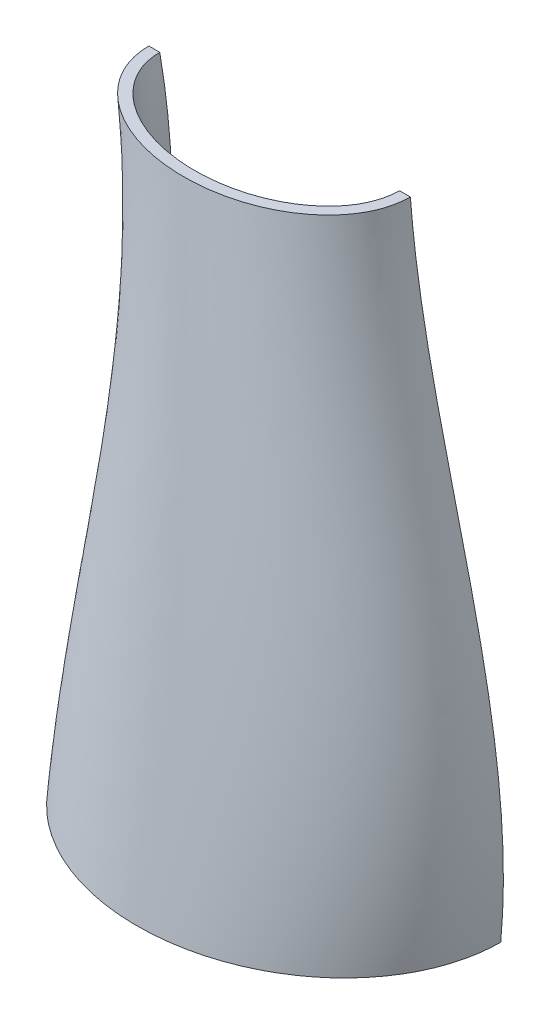
ISO-10303-21;
HEADER;
FILE_DESCRIPTION(('STEP AP214'),'2;1');
FILE_NAME('part.step','',(''),(''),'','','');
FILE_SCHEMA(('AUTOMOTIVE_DESIGN { 1 0 10303 214 1 1 1 1 }'));
ENDSEC;
DATA;
#1=APPLICATION_CONTEXT('core data for automotive mechanical design processes');
#2=APPLICATION_PROTOCOL_DEFINITION('international standard','automotive_design',2000,#1);
#3=PRODUCT_CONTEXT('',#1,'mechanical');
#4=PRODUCT('Part','Part','',(#3));
#5=PRODUCT_RELATED_PRODUCT_CATEGORY('part','',(#4));
#6=PRODUCT_DEFINITION_FORMATION('','',#4);
#7=PRODUCT_DEFINITION_CONTEXT('part definition',#1,'design');
#8=PRODUCT_DEFINITION('design','',#6,#7);
#9=PRODUCT_DEFINITION_SHAPE('','',#8);
#10=(LENGTH_UNIT() NAMED_UNIT(*) SI_UNIT(.MILLI.,.METRE.));
#11=(NAMED_UNIT(*) PLANE_ANGLE_UNIT() SI_UNIT($,.RADIAN.));
#12=(NAMED_UNIT(*) SI_UNIT($,.STERADIAN.) SOLID_ANGLE_UNIT());
#13=UNCERTAINTY_MEASURE_WITH_UNIT(LENGTH_MEASURE(1.E-05),#10,'distance_accuracy_value','');
#14=(GEOMETRIC_REPRESENTATION_CONTEXT(3) GLOBAL_UNCERTAINTY_ASSIGNED_CONTEXT((#13)) GLOBAL_UNIT_ASSIGNED_CONTEXT((#10,
#11,#12)) REPRESENTATION_CONTEXT('',''));
#15=CARTESIAN_POINT('',(0.,0.,0.));
#16=DIRECTION('',(0.,0.,1.));
#17=DIRECTION('',(1.,0.,0.));
#18=AXIS2_PLACEMENT_3D('',#15,#16,#17);
#19=CARTESIAN_POINT('',(0.,0.,0.));
#20=DIRECTION('',(0.,0.,1.));
#21=DIRECTION('',(1.,0.,0.));
#22=AXIS2_PLACEMENT_3D('',#19,#20,#21);
#23=PLANE('',#22);
#24=DIRECTION('',(1.,0.,0.));
#25=VECTOR('',#24,1.);
#26=CARTESIAN_POINT('',(-5.74133440751285,137.746177695902,0.));
#27=LINE('',#26,#25);
#28=CARTESIAN_POINT('',(-35.7453675505774,137.746177695902,0.));
#29=VERTEX_POINT('',#28);
#30=CARTESIAN_POINT('',(-33.2453675505774,137.746177695902,0.));
#31=VERTEX_POINT('',#30);
#32=EDGE_CURVE('E97',#29,#31,#27,.T.);
#33=ORIENTED_EDGE('',*,*,#32,.T.);
#34=CARTESIAN_POINT('',(-33.2453675505774,137.746177695902,0.));
#35=CARTESIAN_POINT('',(-23.7228053651667,91.9679244996649,0.));
#36=CARTESIAN_POINT('',(-40.9724969984661,45.5723941263997,0.));
#37=CARTESIAN_POINT('',(-42.5,0.,0.));
#38=B_SPLINE_CURVE_WITH_KNOTS('',3,(#34,#35,#36,#37),.UNSPECIFIED.,.F.,.F.,(4,4),(0.,1.),.UNSPECIFIED.);
#39=CARTESIAN_POINT('',(-42.5,0.,0.));
#40=VERTEX_POINT('',#39);
#41=EDGE_CURVE('E86',#40,#31,#38,.F.);
#42=ORIENTED_EDGE('',*,*,#41,.F.);
#43=DIRECTION('',(-1.,0.,0.));
#44=VECTOR('',#43,1.);
#45=CARTESIAN_POINT('',(-45.,0.,0.));
#46=LINE('',#45,#44);
#47=CARTESIAN_POINT('',(-45.,0.,0.));
#48=VERTEX_POINT('',#47);
#49=EDGE_CURVE('E11',#40,#48,#46,.T.);
#50=ORIENTED_EDGE('',*,*,#49,.T.);
#51=CARTESIAN_POINT('',(-35.7453675505774,137.746177695902,0.));
#52=CARTESIAN_POINT('',(-35.5595474938632,136.852922609057,0.));
#53=CARTESIAN_POINT('',(-35.3835655688667,135.957633077733,0.));
#54=CARTESIAN_POINT('',(-35.0509249227353,134.163498430557,0.));
#55=CARTESIAN_POINT('',(-34.8942656055208,133.264653425269,0.));
#56=CARTESIAN_POINT('',(-34.6000545202637,131.464776426126,0.));
#57=CARTESIAN_POINT('',(-34.4624835908796,130.563747562841,0.));
#58=CARTESIAN_POINT('',(-34.2058339385276,128.759068113073,0.));
#59=CARTESIAN_POINT('',(-34.0867553604639,127.855417506104,0.));
#60=CARTESIAN_POINT('',(-33.7566342192219,125.141752197597,0.));
#61=CARTESIAN_POINT('',(-33.5726031495867,123.328388727618,0.));
#62=CARTESIAN_POINT('',(-33.2739291112574,119.715195430844,0.));
#63=CARTESIAN_POINT('',(-33.1585798192245,117.915422690675,0.));
#64=CARTESIAN_POINT('',(-32.9895886533308,114.31259407196,0.));
#65=CARTESIAN_POINT('',(-32.935961237129,112.509537523242,0.));
#66=CARTESIAN_POINT('',(-32.8854463467354,108.902575690908,0.));
#67=CARTESIAN_POINT('',(-32.8885631183912,107.098670353881,0.));
#68=CARTESIAN_POINT('',(-32.9644481886645,102.36011292607,0.));
#69=CARTESIAN_POINT('',(-33.0796895793198,99.4261129660154,0.));
#70=CARTESIAN_POINT('',(-33.4236415171862,93.5646145123182,0.));
#71=CARTESIAN_POINT('',(-33.6523740902568,90.6371173915413,0.));
#72=CARTESIAN_POINT('',(-34.2004194441202,84.7905710950553,0.));
#73=CARTESIAN_POINT('',(-34.5197397277337,81.8715226393354,0.));
#74=CARTESIAN_POINT('',(-35.2289195882609,76.023162613752,0.));
#75=CARTESIAN_POINT('',(-35.6192190740278,73.0939055525308,0.));
#76=CARTESIAN_POINT('',(-36.4469075840715,67.2425794491222,0.));
#77=CARTESIAN_POINT('',(-36.8842900886601,64.3205094688945,0.));
#78=CARTESIAN_POINT('',(-37.7848458839172,58.4800554366835,0.));
#79=CARTESIAN_POINT('',(-38.2480223005575,55.5616718754797,0.));
#80=CARTESIAN_POINT('',(-39.4126764861835,48.2614620508596,0.));
#81=CARTESIAN_POINT('',(-40.1171112609525,43.8800952730894,0.));
#82=CARTESIAN_POINT('',(-41.1278243241707,37.3016063549679,0.));
#83=CARTESIAN_POINT('',(-41.4570227906532,35.108057744502,0.));
#84=CARTESIAN_POINT('',(-42.0909372285906,30.7174443576782,0.));
#85=CARTESIAN_POINT('',(-42.3956537434673,28.5203796604709,0.));
#86=CARTESIAN_POINT('',(-42.9690037701936,24.1384342145933,0.));
#87=CARTESIAN_POINT('',(-43.2378933044445,21.953587361223,0.));
#88=CARTESIAN_POINT('',(-43.7327468230017,17.5791600237908,0.));
#89=CARTESIAN_POINT('',(-43.9587141940709,15.3895799270041,0.));
#90=CARTESIAN_POINT('',(-44.3582106390014,11.0025958695234,0.));
#91=CARTESIAN_POINT('',(-44.5316698070173,8.80518538520979,0.));
#92=CARTESIAN_POINT('',(-44.8156315553848,4.40570175686467,0.));
#93=CARTESIAN_POINT('',(-44.9261156673952,2.20362743493561,0.));
#94=CARTESIAN_POINT('',(-44.9999999999999,0.,0.));
#95=B_SPLINE_CURVE_WITH_KNOTS('',3,(#51,#52,#53,#54,#55,#56,#57,#58,#59,#60,#61,#62,#63,#64,#65,
#66,#67,#68,#69,#70,#71,#72,#73,#74,#75,#76,#77,#78,#79,#80,#81,#82,#83,#84,#85,#86,#87,#88,#89,
#90,#91,#92,#93,#94),.UNSPECIFIED.,.F.,.F.,(4,2,2,2,2,2,2,2,2,2,2,2,2,2,2,2,2,2,2,2,2,4),(0.,
2.73706078139401,5.47403710657353,8.20824580481467,10.9424759269644,16.4090068087981,
21.8183028142309,27.2288656290366,32.6398332874075,41.4456898934172,50.2532561694115,
59.0615521348109,67.9264249131878,76.7900717285387,85.6547950794237,98.9675740426821,
105.621818326582,112.2759148665,118.879568881186,125.482701619498,132.09458704296,
138.708410500624),.UNSPECIFIED.);
#96=EDGE_CURVE('E64',#29,#48,#95,.T.);
#97=ORIENTED_EDGE('',*,*,#96,.F.);
#98=EDGE_LOOP('',(#33,#42,#50,#97));
#99=FACE_BOUND('',#98,.T.);
#100=ADVANCED_FACE('F38',(#99),#23,.F.);
#101=CARTESIAN_POINT('',(21.7626987355517,137.746177695902,0.));
#102=VERTEX_POINT('',#101);
#103=CARTESIAN_POINT('',(24.2626987355517,137.746177695902,0.));
#104=VERTEX_POINT('',#103);
#105=EDGE_CURVE('E101',#102,#104,#27,.T.);
#106=ORIENTED_EDGE('',*,*,#105,.T.);
#107=CARTESIAN_POINT('',(45.,0.,-2.25145142243241E-06));
#108=CARTESIAN_POINT('',(49.4561709237232,47.413664139623,0.));
#109=CARTESIAN_POINT('',(28.054924480837,91.2082843321231,0.));
#110=CARTESIAN_POINT('',(24.2626987355517,137.746177695902,0.));
#111=B_SPLINE_CURVE_WITH_KNOTS('',3,(#107,#108,#109,#110),.UNSPECIFIED.,.F.,.F.,(4,4),(0.,1.),.UNSPECIFIED.);
#112=CARTESIAN_POINT('',(45.,0.,-2.25145141930639E-06));
#113=VERTEX_POINT('',#112);
#114=EDGE_CURVE('E57',#113,#104,#111,.T.);
#115=ORIENTED_EDGE('',*,*,#114,.F.);
#116=CARTESIAN_POINT('',(42.5,0.,0.));
#117=VERTEX_POINT('',#116);
#118=EDGE_CURVE('E50',#113,#117,#46,.T.);
#119=ORIENTED_EDGE('',*,*,#118,.T.);
#120=CARTESIAN_POINT('',(21.7626987355517,137.746177695902,0.));
#121=CARTESIAN_POINT('',(21.8542622747051,136.622462265402,0.));
#122=CARTESIAN_POINT('',(21.9561606690326,135.499626713591,0.));
#123=CARTESIAN_POINT('',(22.1794109192749,133.255942133521,0.));
#124=CARTESIAN_POINT('',(22.3007618422226,132.135093012595,0.));
#125=CARTESIAN_POINT('',(22.6921027544701,128.776400754926,0.));
#126=CARTESIAN_POINT('',(22.9894393760284,126.541713246958,0.));
#127=CARTESIAN_POINT('',(23.6460661237931,122.088330462632,0.));
#128=CARTESIAN_POINT('',(24.0051711569487,119.869607467939,0.));
#129=CARTESIAN_POINT('',(24.7759508582164,115.44127104607,0.));
#130=CARTESIAN_POINT('',(25.1876279798628,113.23165804903,0.));
#131=CARTESIAN_POINT('',(26.5209266220415,106.44027736159,0.));
#132=CARTESIAN_POINT('',(27.5133221204681,101.872519176814,0.));
#133=CARTESIAN_POINT('',(29.5944724178173,92.7587961077402,0.));
#134=CARTESIAN_POINT('',(30.6832489370951,88.212836380498,0.));
#135=CARTESIAN_POINT('',(32.8728274763162,79.1171930939584,0.));
#136=CARTESIAN_POINT('',(33.9736440982213,74.5675131320239,0.));
#137=CARTESIAN_POINT('',(36.0995265453355,65.4508566176189,0.));
#138=CARTESIAN_POINT('',(37.1246091106237,60.8838841234833,0.));
#139=CARTESIAN_POINT('',(38.539129650978,54.0074303232394,0.));
#140=CARTESIAN_POINT('',(38.9901535975966,51.7107430205107,0.));
#141=CARTESIAN_POINT('',(39.839714743747,47.107519319292,0.));
#142=CARTESIAN_POINT('',(40.2382503111579,44.8009826168373,0.));
#143=CARTESIAN_POINT('',(40.9707694798854,40.1808565825125,0.));
#144=CARTESIAN_POINT('',(41.3048415740079,37.8672814118214,0.));
#145=CARTESIAN_POINT('',(41.8976056477479,33.2302715062465,0.));
#146=CARTESIAN_POINT('',(42.1562959465463,30.9068365526868,0.));
#147=CARTESIAN_POINT('',(42.5178205772586,26.9995817251936,0.));
#148=CARTESIAN_POINT('',(42.6440268148776,25.4179120854782,0.));
#149=CARTESIAN_POINT('',(42.8531222224539,22.2517105546818,0.));
#150=CARTESIAN_POINT('',(42.9360124999787,20.667178737825,0.));
#151=CARTESIAN_POINT('',(43.0552589068098,17.4965404636477,0.));
#152=CARTESIAN_POINT('',(43.0916210150835,15.9104342348625,0.));
#153=CARTESIAN_POINT('',(43.1149230223741,12.7310076720311,0.));
#154=CARTESIAN_POINT('',(43.1016494557444,11.1376856803827,0.));
#155=CARTESIAN_POINT('',(43.0225168594514,7.9520226029834,0.));
#156=CARTESIAN_POINT('',(42.9566491885177,6.35968172145888,0.));
#157=CARTESIAN_POINT('',(42.8166814199491,3.97319010331323,0.));
#158=CARTESIAN_POINT('',(42.7631423107808,3.17779228541036,0.));
#159=CARTESIAN_POINT('',(42.6421013987205,1.58804715942509,0.));
#160=CARTESIAN_POINT('',(42.5745993631829,0.793699869068197,0.));
#161=CARTESIAN_POINT('',(42.5,0.,0.));
#162=B_SPLINE_CURVE_WITH_KNOTS('',3,(#120,#121,#122,#123,#124,#125,#126,#127,#128,#129,#130,
#131,#132,#133,#134,#135,#136,#137,#138,#139,#140,#141,#142,#143,#144,#145,#146,#147,#148,#149,
#150,#151,#152,#153,#154,#155,#156,#157,#158,#159,#160,#161),.UNSPECIFIED.,.F.,.F.,(4,2,2,2,2,2,
2,2,2,2,2,2,2,2,2,2,2,2,2,2,4),(0.,3.38220847530561,6.76425478427519,13.5262427338768,
20.268310135906,27.0106923046422,41.0310366834324,55.0545487597252,69.0975381554799,
83.1374141769162,90.1585896862525,97.1799834668232,104.191668904945,111.203510673558,
115.96308261272,120.722532846049,125.481371418592,130.26069957902,135.040813150051,
137.432298710414,139.823824120133),.UNSPECIFIED.);
#163=EDGE_CURVE('E95',#102,#117,#162,.T.);
#164=ORIENTED_EDGE('',*,*,#163,.F.);
#165=EDGE_LOOP('',(#106,#115,#119,#164));
#166=FACE_BOUND('',#165,.T.);
#167=ADVANCED_FACE('F127',(#166),#23,.F.);
#168=CARTESIAN_POINT('',(-5.74133440751285,137.746177695902,0.));
#169=DIRECTION('',(0.,1.,0.));
#170=DIRECTION('',(0.,0.,1.));
#171=AXIS2_PLACEMENT_3D('',#168,#169,#170);
#172=PLANE('',#171);
#173=ORIENTED_EDGE('',*,*,#32,.F.);
#174=CARTESIAN_POINT('',(24.2626987355517,137.746177695902,0.));
#175=CARTESIAN_POINT('',(24.2626987355517,137.746177695902,1.71192230347683));
#176=CARTESIAN_POINT('',(23.70745232701,137.746177695902,5.13345222903807));
#177=CARTESIAN_POINT('',(21.3982696492388,137.746177695902,9.77767007885996));
#178=CARTESIAN_POINT('',(18.014055665364,137.746177695903,13.683896414799));
#179=CARTESIAN_POINT('',(13.905322087268,137.746177695902,16.8036713418309));
#180=CARTESIAN_POINT('',(9.32624117622638,137.746177695902,19.1646521683916));
#181=CARTESIAN_POINT('',(4.44835702668646,137.746177695902,20.812723334588));
#182=CARTESIAN_POINT('',(-0.605508485072568,137.746177695902,21.7855440343289));
#183=CARTESIAN_POINT('',(-5.74133440751283,137.746177695902,22.1072017268417));
#184=CARTESIAN_POINT('',(-10.8771603299531,137.746177695903,21.7855440343289));
#185=CARTESIAN_POINT('',(-15.9310258417121,137.746177695902,20.8127233345879));
#186=CARTESIAN_POINT('',(-20.808909991252,137.746177695903,19.1646521683916));
#187=CARTESIAN_POINT('',(-25.3879909022937,137.746177695902,16.8036713418309));
#188=CARTESIAN_POINT('',(-29.4967244803896,137.746177695903,13.6838964147991));
#189=CARTESIAN_POINT('',(-32.8809384642646,137.746177695902,9.77767007885991));
#190=CARTESIAN_POINT('',(-35.1901211420357,137.746177695903,5.13345222903814));
#191=CARTESIAN_POINT('',(-35.7453675505774,137.746177695902,1.71192230347682));
#192=CARTESIAN_POINT('',(-35.7453675505774,137.746177695902,-1.7119208970848));
#193=CARTESIAN_POINT('',(-35.1901220558918,137.746177695903,-5.13344857101133));
#194=CARTESIAN_POINT('',(-32.8809416286749,137.746177695902,-9.77766521138042));
#195=CARTESIAN_POINT('',(-29.4967293411035,137.746177695903,-13.6838918901026));
#196=CARTESIAN_POINT('',(-25.3879964297653,137.746177695902,-16.8036679322315));
#197=CARTESIAN_POINT('',(-20.8089151397536,137.746177695903,-19.164650073215));
#198=CARTESIAN_POINT('',(-15.9310297642119,137.746177695902,-20.8127223893104));
#199=CARTESIAN_POINT('',(-10.8771624393909,137.746177695903,-21.7855438558931));
#200=CARTESIAN_POINT('',(-5.74133440751282,137.746177695902,-22.1072018162096));
#201=CARTESIAN_POINT('',(-0.605506375634823,137.746177695902,-21.7855438558931));
#202=CARTESIAN_POINT('',(4.44836094918624,137.746177695902,-20.8127223893104));
#203=CARTESIAN_POINT('',(9.32624632472796,137.746177695902,-19.164650073215));
#204=CARTESIAN_POINT('',(13.9053276147397,137.746177695903,-16.8036679322315));
#205=CARTESIAN_POINT('',(18.0140605260778,137.746177695902,-13.6838918901026));
#206=CARTESIAN_POINT('',(21.3982728136493,137.746177695903,-9.77766521138045));
#207=CARTESIAN_POINT('',(23.7074532408661,137.746177695902,-5.13344857101131));
#208=CARTESIAN_POINT('',(24.2626987355517,137.746177695902,-1.7119208970848));
#209=CARTESIAN_POINT('',(24.2626987355517,137.746177695902,0.));
#210=B_SPLINE_CURVE_WITH_KNOTS('',3,(#174,#175,#176,#177,#178,#179,#180,#181,#182,#183,#184,
#185,#186,#187,#188,#189,#190,#191,#192,#193,#194,#195,#196,#197,#198,#199,#200,#201,#202,#203,
#204,#205,#206,#207,#208,#209),.UNSPECIFIED.,.T.,.F.,(4,1,1,1,1,1,1,1,1,1,1,1,1,1,1,1,2,1,1,1,1,
1,1,1,1,1,1,1,1,1,1,1,4),(0.,0.0312500128363795,0.062500025672759,0.0937500385091383,
0.125000051345518,0.156250064181897,0.187500077018276,0.218750089854656,0.250000102691036,
0.281250115527415,0.312500128363794,0.343750141200174,0.375000154036553,0.406250166872933,
0.437500179709312,0.468750192545692,0.500000205382071,0.531250192545692,0.562500179709312,
0.593750166872933,0.625000154036554,0.656250141200174,0.687500128363794,0.718750115527415,
0.750000102691036,0.781250089854656,0.812500077018277,0.843750064181897,0.875000051345518,
0.906250038509138,0.937500025672759,0.96875001283638,1.),.UNSPECIFIED.);
#211=EDGE_CURVE('E150',#29,#104,#210,.F.);
#212=ORIENTED_EDGE('',*,*,#211,.T.);
#213=ORIENTED_EDGE('',*,*,#105,.F.);
#214=CARTESIAN_POINT('',(-33.2453675505774,137.746177695902,0.));
#215=CARTESIAN_POINT('',(-33.2453675505774,137.746177695902,1.54825783950049));
#216=CARTESIAN_POINT('',(-32.7098210924575,137.746177695902,4.64325631327878));
#217=CARTESIAN_POINT('',(-30.5012643255427,137.746177695903,8.7839345965946));
#218=CARTESIAN_POINT('',(-27.3474167026364,137.746177695902,12.2322468601318));
#219=CARTESIAN_POINT('',(-23.568249482996,137.746177695903,14.9665037497497));
#220=CARTESIAN_POINT('',(-19.3898698752269,137.746177695902,17.026316924509));
#221=CARTESIAN_POINT('',(-14.9628250716892,137.746177695903,18.4667099237039));
#222=CARTESIAN_POINT('',(-10.3857607589649,137.746177695902,19.3095786456236));
#223=CARTESIAN_POINT('',(-5.74133440751286,137.746177695903,19.5954616478668));
#224=CARTESIAN_POINT('',(-1.09690805606092,137.746177695902,19.3095786456237));
#225=CARTESIAN_POINT('',(3.48015625666352,137.746177695903,18.4667099237038));
#226=CARTESIAN_POINT('',(7.90720106020117,137.746177695902,17.026316924509));
#227=CARTESIAN_POINT('',(12.0855806679703,137.746177695903,14.9665037497497));
#228=CARTESIAN_POINT('',(15.8647478876107,137.746177695902,12.2322468601319));
#229=CARTESIAN_POINT('',(19.0185955105169,137.746177695903,8.7839345965946));
#230=CARTESIAN_POINT('',(21.2271522774318,137.746177695902,4.64325631327881));
#231=CARTESIAN_POINT('',(21.7626987355517,137.746177695902,1.54825783950049));
#232=CARTESIAN_POINT('',(21.7626987355517,137.746177695902,-1.54825783950049));
#233=CARTESIAN_POINT('',(21.2271522774318,137.746177695902,-4.64325631327874));
#234=CARTESIAN_POINT('',(19.018595510517,137.746177695903,-8.78393459659464));
#235=CARTESIAN_POINT('',(15.8647478876107,137.746177695902,-12.2322468601318));
#236=CARTESIAN_POINT('',(12.0855806679703,137.746177695902,-14.9665037497497));
#237=CARTESIAN_POINT('',(7.9072010602012,137.746177695902,-17.026316924509));
#238=CARTESIAN_POINT('',(3.48015625666354,137.746177695902,-18.4667099237039));
#239=CARTESIAN_POINT('',(-1.09690805606086,137.746177695902,-19.3095786456236));
#240=CARTESIAN_POINT('',(-5.74133440751282,137.746177695902,-19.5954616478669));
#241=CARTESIAN_POINT('',(-10.3857607589648,137.746177695902,-19.3095786456236));
#242=CARTESIAN_POINT('',(-14.9628250716892,137.746177695902,-18.4667099237038));
#243=CARTESIAN_POINT('',(-19.3898698752269,137.746177695902,-17.026316924509));
#244=CARTESIAN_POINT('',(-23.568249482996,137.746177695902,-14.9665037497497));
#245=CARTESIAN_POINT('',(-27.3474167026364,137.746177695902,-12.2322468601319));
#246=CARTESIAN_POINT('',(-30.5012643255426,137.746177695902,-8.78393459659462));
#247=CARTESIAN_POINT('',(-32.7098210924575,137.746177695902,-4.64325631327882));
#248=CARTESIAN_POINT('',(-33.2453675505774,137.746177695902,-1.54825783950049));
#249=CARTESIAN_POINT('',(-33.2453675505774,137.746177695902,0.));
#250=B_SPLINE_CURVE_WITH_KNOTS('',3,(#214,#215,#216,#217,#218,#219,#220,#221,#222,#223,#224,
#225,#226,#227,#228,#229,#230,#231,#232,#233,#234,#235,#236,#237,#238,#239,#240,#241,#242,#243,
#244,#245,#246,#247,#248,#249),.UNSPECIFIED.,.T.,.F.,(4,1,1,1,1,1,1,1,1,1,1,1,1,1,1,1,2,1,1,1,1,
1,1,1,1,1,1,1,1,1,1,1,4),(0.,0.03125,0.0625,0.09375,0.125,0.15625,0.1875,0.21875,0.25,0.28125,
0.3125,0.34375,0.375,0.40625,0.4375,0.46875,0.5,0.53125,0.5625,0.59375,0.625,0.65625,0.6875,
0.71875,0.75,0.78125,0.8125,0.84375,0.875,0.90625,0.9375,0.96875,1.),.UNSPECIFIED.);
#251=EDGE_CURVE('E89',#31,#102,#250,.T.);
#252=ORIENTED_EDGE('',*,*,#251,.F.);
#253=EDGE_LOOP('',(#173,#212,#213,#252));
#254=FACE_BOUND('',#253,.T.);
#255=ADVANCED_FACE('F105',(#254),#172,.T.);
#256=CARTESIAN_POINT('',(-45.,0.,0.));
#257=DIRECTION('',(0.,-1.,0.));
#258=DIRECTION('',(0.,0.,-1.));
#259=AXIS2_PLACEMENT_3D('',#256,#257,#258);
#260=PLANE('',#259);
#261=ORIENTED_EDGE('',*,*,#118,.F.);
#262=CARTESIAN_POINT('',(45.,0.,-2.25145142243241E-06));
#263=CARTESIAN_POINT('',(45.,0.,-2.73686717661151));
#264=CARTESIAN_POINT('',(44.3057460111731,0.,-8.20859539809534));
#265=CARTESIAN_POINT('',(41.3339830567258,0.,-15.9245230795289));
#266=CARTESIAN_POINT('',(36.682542208869,0.,-22.751088411424));
#267=CARTESIAN_POINT('',(30.7343092374187,0.,-28.4683400546408));
#268=CARTESIAN_POINT('',(23.8086999335155,0.,-32.943452438197));
#269=CARTESIAN_POINT('',(16.2212799688463,0.,-36.1545026262331));
#270=CARTESIAN_POINT('',(8.20929478909903,0.,-38.068987669668));
#271=CARTESIAN_POINT('',(-0.000614732027113749,0.,-38.7156778606779));
#272=CARTESIAN_POINT('',(-8.21062839554504,0.,-38.0687850929858));
#273=CARTESIAN_POINT('',(-16.2224000346934,0.,-36.1541109896919));
#274=CARTESIAN_POINT('',(-23.8100058350482,0.,-32.9428392595297));
#275=CARTESIAN_POINT('',(-30.7350794692783,0.,-28.4675670066756));
#276=CARTESIAN_POINT('',(-36.6837771732156,0.,-22.7500559954045));
#277=CARTESIAN_POINT('',(-41.3344397309365,0.,-15.9240138472673));
#278=CARTESIAN_POINT('',(-44.3120314139607,0.,-8.20938990686695));
#279=CARTESIAN_POINT('',(-45.,0.,-2.73686717661151));
#280=CARTESIAN_POINT('',(-45.,0.,2.73686492212152));
#281=CARTESIAN_POINT('',(-44.3120325345704,0.,8.20938403172624));
#282=CARTESIAN_POINT('',(-41.3344439110324,0.,15.9240055856622));
#283=CARTESIAN_POINT('',(-36.6837840267944,0.,22.7500478814666));
#284=CARTESIAN_POINT('',(-30.7350876731417,0.,28.4675606264363));
#285=CARTESIAN_POINT('',(-23.8100137650883,0.,32.9428352171327));
#286=CARTESIAN_POINT('',(-16.2224062198271,0.,36.1541091270514));
#287=CARTESIAN_POINT('',(-8.21063176872078,0.,38.0687847400005));
#288=CARTESIAN_POINT('',(-0.00061473211439983,0.,38.7156780358047));
#289=CARTESIAN_POINT('',(8.2092981624868,0.,38.0689873167756));
#290=CARTESIAN_POINT('',(16.2212861537125,0.,36.1545007637221));
#291=CARTESIAN_POINT('',(23.8087078641851,0.,32.9434483960676));
#292=CARTESIAN_POINT('',(30.7343174407357,0.,28.4683336745709));
#293=CARTESIAN_POINT('',(36.6825490639366,0.,22.7510802977965));
#294=CARTESIAN_POINT('',(41.3339872324949,0.,15.9245148161237));
#295=CARTESIAN_POINT('',(44.3057471333271,0.,8.20858952337777));
#296=CARTESIAN_POINT('',(45.,0.,2.73686492212154));
#297=CARTESIAN_POINT('',(45.,0.,-2.25145142243241E-06));
#298=B_SPLINE_CURVE_WITH_KNOTS('',3,(#262,#263,#264,#265,#266,#267,#268,#269,#270,#271,#272,
#273,#274,#275,#276,#277,#278,#279,#280,#281,#282,#283,#284,#285,#286,#287,#288,#289,#290,#291,
#292,#293,#294,#295,#296,#297),.UNSPECIFIED.,.T.,.F.,(4,1,1,1,1,1,1,1,1,1,1,1,1,1,1,1,2,1,1,1,1,
1,1,1,1,1,1,1,1,1,1,1,4),(0.,0.0312499871636205,0.0624999743272411,0.0937499614908616,
0.124999948654482,0.156249935818103,0.187499922981723,0.218749910145344,0.249999897308964,
0.281249884472585,0.312499871636206,0.343749858799826,0.374999845963446,0.406249833127067,
0.437499820290688,0.468749807454308,0.499999794617929,0.531249807454308,0.562499820290688,
0.593749833127067,0.624999845963447,0.656249858799826,0.687499871636206,0.718749884472585,
0.749999897308964,0.781249910145344,0.812499922981724,0.843749935818103,0.874999948654482,
0.906249961490862,0.937499974327241,0.96874998716362,1.),.UNSPECIFIED.);
#299=EDGE_CURVE('E148',#48,#113,#298,.T.);
#300=ORIENTED_EDGE('',*,*,#299,.F.);
#301=ORIENTED_EDGE('',*,*,#49,.F.);
#302=CARTESIAN_POINT('',(-42.5,0.,0.));
#303=CARTESIAN_POINT('',(-42.5,0.,-2.57331164553657));
#304=CARTESIAN_POINT('',(-41.8427189830769,0.,-7.71913199027887));
#305=CARTESIAN_POINT('',(-38.9962137706121,0.,-14.955749557565));
#306=CARTESIAN_POINT('',(-34.5810694440578,0.,-21.3445830754876));
#307=CARTESIAN_POINT('',(-28.9411128842564,0.,-26.6729178391327));
#308=CARTESIAN_POINT('',(-22.4086214436498,0.,-30.8424290004991));
#309=CARTESIAN_POINT('',(-15.2540665856768,0.,-33.8204946605132));
#310=CARTESIAN_POINT('',(-7.72152897981141,0.,-35.6043475794263));
#311=CARTESIAN_POINT('',(0.,0.,-36.1977208536077));
#312=CARTESIAN_POINT('',(7.72152897981145,0.,-35.6043475794263));
#313=CARTESIAN_POINT('',(15.2540665856767,0.,-33.8204946605132));
#314=CARTESIAN_POINT('',(22.4086214436499,0.,-30.8424290004991));
#315=CARTESIAN_POINT('',(28.9411128842563,0.,-26.6729178391325));
#316=CARTESIAN_POINT('',(34.581069444058,0.,-21.3445830754877));
#317=CARTESIAN_POINT('',(38.9962137706119,0.,-14.9557495575648));
#318=CARTESIAN_POINT('',(41.842718983077,0.,-7.71913199027889));
#319=CARTESIAN_POINT('',(42.5,0.,-2.57331164553657));
#320=CARTESIAN_POINT('',(42.5,0.,2.57331164553657));
#321=CARTESIAN_POINT('',(41.8427189830769,0.,7.71913199027889));
#322=CARTESIAN_POINT('',(38.9962137706121,0.,14.9557495575649));
#323=CARTESIAN_POINT('',(34.5810694440578,0.,21.3445830754876));
#324=CARTESIAN_POINT('',(28.9411128842564,0.,26.6729178391326));
#325=CARTESIAN_POINT('',(22.4086214436498,0.,30.8424290004991));
#326=CARTESIAN_POINT('',(15.2540665856768,0.,33.8204946605132));
#327=CARTESIAN_POINT('',(7.72152897981141,0.,35.6043475794264));
#328=CARTESIAN_POINT('',(0.,0.,36.1977208536077));
#329=CARTESIAN_POINT('',(-7.7215289798115,0.,35.6043475794263));
#330=CARTESIAN_POINT('',(-15.2540665856768,0.,33.8204946605131));
#331=CARTESIAN_POINT('',(-22.4086214436498,0.,30.8424290004991));
#332=CARTESIAN_POINT('',(-28.9411128842565,0.,26.6729178391325));
#333=CARTESIAN_POINT('',(-34.5810694440578,0.,21.3445830754877));
#334=CARTESIAN_POINT('',(-38.996213770612,0.,14.9557495575648));
#335=CARTESIAN_POINT('',(-41.842718983077,0.,7.71913199027893));
#336=CARTESIAN_POINT('',(-42.5,0.,2.57331164553656));
#337=CARTESIAN_POINT('',(-42.5,0.,0.));
#338=B_SPLINE_CURVE_WITH_KNOTS('',3,(#302,#303,#304,#305,#306,#307,#308,#309,#310,#311,#312,
#313,#314,#315,#316,#317,#318,#319,#320,#321,#322,#323,#324,#325,#326,#327,#328,#329,#330,#331,
#332,#333,#334,#335,#336,#337),.UNSPECIFIED.,.T.,.F.,(4,1,1,1,1,1,1,1,1,1,1,1,1,1,1,1,2,1,1,1,1,
1,1,1,1,1,1,1,1,1,1,1,4),(0.,0.03125,0.0625,0.09375,0.125,0.15625,0.1875,0.21875,0.25,0.28125,
0.3125,0.34375,0.375,0.40625,0.4375,0.46875,0.5,0.53125,0.5625,0.59375,0.625,0.65625,0.6875,
0.71875,0.75,0.78125,0.8125,0.84375,0.875,0.90625,0.9375,0.96875,1.),.UNSPECIFIED.);
#339=EDGE_CURVE('E92',#40,#117,#338,.F.);
#340=ORIENTED_EDGE('',*,*,#339,.T.);
#341=EDGE_LOOP('',(#261,#300,#301,#340));
#342=FACE_BOUND('',#341,.T.);
#343=ADVANCED_FACE('F126',(#342),#260,.T.);
#344=CARTESIAN_POINT('',(-33.2453675505774,137.746177695902,0.));
#345=CARTESIAN_POINT('',(-23.7228053651667,91.9679244996649,0.));
#346=CARTESIAN_POINT('',(-40.9724969984661,45.5723941263997,0.));
#347=CARTESIAN_POINT('',(-42.5,0.,0.));
#348=CARTESIAN_POINT('',(-33.2453675505774,137.746177695902,-1.54825783950049));
#349=CARTESIAN_POINT('',(-23.7228053651667,91.9679244996649,-1.88994244151252));
#350=CARTESIAN_POINT('',(-40.9724969984661,45.5723941263997,-2.23162704352454));
#351=CARTESIAN_POINT('',(-42.5,0.,-2.57331164553657));
#352=CARTESIAN_POINT('',(-32.7098210924575,137.746177695902,-4.64325631327882));
#353=CARTESIAN_POINT('',(-23.2695529682641,91.9619898108559,-5.66854820561216));
#354=CARTESIAN_POINT('',(-40.2548099556221,45.5867790483779,-6.69384009794551));
#355=CARTESIAN_POINT('',(-41.8427189830769,0.,-7.71913199027887));
#356=CARTESIAN_POINT('',(-30.5012643255426,137.746177695902,-8.78393459659462));
#357=CARTESIAN_POINT('',(-21.3551947403749,91.9375092195193,-10.8412062502514));
#358=CARTESIAN_POINT('',(-37.2043943497291,45.6461168515385,-12.8984779039082));
#359=CARTESIAN_POINT('',(-38.9962137706121,0.,-14.955749557565));
#360=CARTESIAN_POINT('',(-27.3474167026364,137.746177695902,-12.2322468601319));
#361=CARTESIAN_POINT('',(-18.5642254606363,91.8996755783624,-15.2696922652504));
#362=CARTESIAN_POINT('',(-32.5659079050216,45.7378207291502,-18.307137670369));
#363=CARTESIAN_POINT('',(-34.5810694440578,0.,-21.3445830754876));
#364=CARTESIAN_POINT('',(-23.568249482996,137.746177695902,-14.9665037497497));
#365=CARTESIAN_POINT('',(-15.1784911693603,91.8507143956888,-18.868641779544));
#366=CARTESIAN_POINT('',(-26.7130947080509,45.8564963354713,-22.7707798093383));
#367=CARTESIAN_POINT('',(-28.9411128842564,0.,-26.6729178391327));
#368=CARTESIAN_POINT('',(-19.3898698752269,137.746177695902,-17.026316924509));
#369=CARTESIAN_POINT('',(-11.413412030291,91.7928511798018,-21.6316876165057));
#370=CARTESIAN_POINT('',(-19.9807111428842,45.9967493247597,-26.2370583085024));
#371=CARTESIAN_POINT('',(-22.4086214436498,0.,-30.8424290004991));
#372=CARTESIAN_POINT('',(-14.9628250716892,137.746177695902,-18.4667099237038));
#373=CARTESIAN_POINT('',(-7.41343290000779,91.7283114390048,-23.584638169307));
#374=CARTESIAN_POINT('',(-12.6371229955048,46.1531853512738,-28.7025664149101));
#375=CARTESIAN_POINT('',(-15.2540665856768,0.,-33.8204946605132));
#376=CARTESIAN_POINT('',(-10.3857607589648,137.746177695902,-19.3095786456236));
#377=CARTESIAN_POINT('',(-3.2796006999164,91.659320681601,-24.7411682902245));
#378=CARTESIAN_POINT('',(-4.91580168732677,46.3204100692716,-30.1727579348254));
#379=CARTESIAN_POINT('',(-7.72152897981141,0.,-35.6043475794263));
#380=CARTESIAN_POINT('',(-5.74133440751282,137.746177695902,-19.5954616478669));
#381=CARTESIAN_POINT('',(0.916059557835182,91.5881044158941,-25.1295480497805));
#382=CARTESIAN_POINT('',(2.99183696262859,46.4930291330114,-30.6636344516941));
#383=CARTESIAN_POINT('',(0.,0.,-36.1977208536077));
#384=CARTESIAN_POINT('',(-1.09690805606086,137.746177695902,-19.3095786456236));
#385=CARTESIAN_POINT('',(5.11171981558672,91.516888150187,-24.7411682902245));
#386=CARTESIAN_POINT('',(10.8994756125839,46.6656481967511,-30.1727579348254));
#387=CARTESIAN_POINT('',(7.72152897981145,0.,-35.6043475794263));
#388=CARTESIAN_POINT('',(3.48015625666354,137.746177695902,-18.4667099237039));
#389=CARTESIAN_POINT('',(9.24555201567807,91.4478973927832,-23.584638169307));
#390=CARTESIAN_POINT('',(18.6207969207618,46.8328729147488,-28.7025664149101));
#391=CARTESIAN_POINT('',(15.2540665856767,0.,-33.8204946605132));
#392=CARTESIAN_POINT('',(7.9072010602012,137.746177695902,-17.026316924509));
#393=CARTESIAN_POINT('',(13.2455311459613,91.3833576519863,-21.6316876165057));
#394=CARTESIAN_POINT('',(25.9643850681413,46.989308941263,-26.2370583085024));
#395=CARTESIAN_POINT('',(22.4086214436499,0.,-30.8424290004991));
#396=CARTESIAN_POINT('',(12.0855806679703,137.746177695902,-14.9665037497497));
#397=CARTESIAN_POINT('',(17.0106102850306,91.3254944360992,-18.868641779544));
#398=CARTESIAN_POINT('',(32.6967686333079,47.1295619305514,-22.7707798093383));
#399=CARTESIAN_POINT('',(28.9411128842563,0.,-26.6729178391325));
#400=CARTESIAN_POINT('',(15.8647478876107,137.746177695902,-12.2322468601318));
#401=CARTESIAN_POINT('',(20.3963445763067,91.2765332534256,-15.2696922652504));
#402=CARTESIAN_POINT('',(38.5495818302788,47.2482375368724,-18.307137670369));
#403=CARTESIAN_POINT('',(34.581069444058,0.,-21.3445830754877));
#404=CARTESIAN_POINT('',(19.018595510517,137.746177695903,-8.78393459659464));
#405=CARTESIAN_POINT('',(23.1873138560452,91.238699612269,-10.8412062502514));
#406=CARTESIAN_POINT('',(43.1880682749861,47.3399414144843,-12.8984779039081));
#407=CARTESIAN_POINT('',(38.9962137706119,0.,-14.9557495575648));
#408=CARTESIAN_POINT('',(21.2271522774318,137.746177695902,-4.64325631327874));
#409=CARTESIAN_POINT('',(25.1016720839344,91.2142190209319,-5.66854820561213));
#410=CARTESIAN_POINT('',(46.2384838808792,47.3992792176446,-6.69384009794551));
#411=CARTESIAN_POINT('',(41.842718983077,0.,-7.71913199027889));
#412=CARTESIAN_POINT('',(21.7626987355517,137.746177695902,-1.54825783950049));
#413=CARTESIAN_POINT('',(25.554924480837,91.2082843321231,-1.88994244151252));
#414=CARTESIAN_POINT('',(46.9561709237232,47.413664139623,-2.23162704352454));
#415=CARTESIAN_POINT('',(42.5,0.,-2.57331164553657));
#416=CARTESIAN_POINT('',(21.7626987355517,137.746177695902,1.54825783950049));
#417=CARTESIAN_POINT('',(25.554924480837,91.2082843321231,1.88994244151251));
#418=CARTESIAN_POINT('',(46.9561709237232,47.413664139623,2.23162704352454));
#419=CARTESIAN_POINT('',(42.5,0.,2.57331164553657));
#420=CARTESIAN_POINT('',(21.2271522774318,137.746177695902,4.64325631327881));
#421=CARTESIAN_POINT('',(25.1016720839343,91.2142190209318,5.66854820561216));
#422=CARTESIAN_POINT('',(46.2384838808791,47.3992792176446,6.69384009794552));
#423=CARTESIAN_POINT('',(41.8427189830769,0.,7.71913199027889));
#424=CARTESIAN_POINT('',(19.0185955105169,137.746177695903,8.7839345965946));
#425=CARTESIAN_POINT('',(23.1873138560452,91.2386996122691,10.8412062502514));
#426=CARTESIAN_POINT('',(43.1880682749862,47.3399414144843,12.8984779039081));
#427=CARTESIAN_POINT('',(38.9962137706121,0.,14.9557495575649));
#428=CARTESIAN_POINT('',(15.8647478876107,137.746177695902,12.2322468601319));
#429=CARTESIAN_POINT('',(20.3963445763066,91.2765332534254,15.2696922652505));
#430=CARTESIAN_POINT('',(38.5495818302786,47.2482375368723,18.307137670369));
#431=CARTESIAN_POINT('',(34.5810694440578,0.,21.3445830754876));
#432=CARTESIAN_POINT('',(12.0855806679703,137.746177695903,14.9665037497497));
#433=CARTESIAN_POINT('',(17.0106102850306,91.3254944360997,18.868641779544));
#434=CARTESIAN_POINT('',(32.696768633308,47.1295619305516,22.7707798093383));
#435=CARTESIAN_POINT('',(28.9411128842564,0.,26.6729178391326));
#436=CARTESIAN_POINT('',(7.90720106020117,137.746177695902,17.026316924509));
#437=CARTESIAN_POINT('',(13.2455311459613,91.3833576519859,21.6316876165057));
#438=CARTESIAN_POINT('',(25.9643850681412,46.9893089412628,26.2370583085024));
#439=CARTESIAN_POINT('',(22.4086214436498,0.,30.8424290004991));
#440=CARTESIAN_POINT('',(3.48015625666352,137.746177695903,18.4667099237038));
#441=CARTESIAN_POINT('',(9.24555201567806,91.4478973927836,23.584638169307));
#442=CARTESIAN_POINT('',(18.6207969207618,46.832872914749,28.7025664149101));
#443=CARTESIAN_POINT('',(15.2540665856768,0.,33.8204946605132));
#444=CARTESIAN_POINT('',(-1.09690805606092,137.746177695902,19.3095786456237));
#445=CARTESIAN_POINT('',(5.11171981558666,91.5168881501866,24.7411682902246));
#446=CARTESIAN_POINT('',(10.8994756125838,46.6656481967509,30.1727579348255));
#447=CARTESIAN_POINT('',(7.72152897981141,0.,35.6043475794264));
#448=CARTESIAN_POINT('',(-5.74133440751286,137.746177695903,19.5954616478668));
#449=CARTESIAN_POINT('',(0.916059557835101,91.5881044158943,25.1295480497805));
#450=CARTESIAN_POINT('',(2.99183696262847,46.4930291330115,30.6636344516941));
#451=CARTESIAN_POINT('',(0.,0.,36.1977208536077));
#452=CARTESIAN_POINT('',(-10.3857607589649,137.746177695902,19.3095786456236));
#453=CARTESIAN_POINT('',(-3.27960069991649,91.6593206816008,24.7411682902245));
#454=CARTESIAN_POINT('',(-4.91580168732685,46.3204100692715,30.1727579348254));
#455=CARTESIAN_POINT('',(-7.7215289798115,0.,35.6043475794263));
#456=CARTESIAN_POINT('',(-14.9628250716892,137.746177695903,18.4667099237039));
#457=CARTESIAN_POINT('',(-7.41343290000779,91.728311439005,23.584638169307));
#458=CARTESIAN_POINT('',(-12.6371229955048,46.1531853512739,28.7025664149101));
#459=CARTESIAN_POINT('',(-15.2540665856768,0.,33.8204946605131));
#460=CARTESIAN_POINT('',(-19.3898698752269,137.746177695902,17.026316924509));
#461=CARTESIAN_POINT('',(-11.413412030291,91.7928511798016,21.6316876165057));
#462=CARTESIAN_POINT('',(-19.9807111428842,45.9967493247596,26.2370583085024));
#463=CARTESIAN_POINT('',(-22.4086214436498,0.,30.8424290004991));
#464=CARTESIAN_POINT('',(-23.568249482996,137.746177695903,14.9665037497497));
#465=CARTESIAN_POINT('',(-15.1784911693604,91.8507143956891,18.8686417795439));
#466=CARTESIAN_POINT('',(-26.7130947080509,45.8564963354714,22.7707798093382));
#467=CARTESIAN_POINT('',(-28.9411128842565,0.,26.6729178391325));
#468=CARTESIAN_POINT('',(-27.3474167026364,137.746177695902,12.2322468601318));
#469=CARTESIAN_POINT('',(-18.5642254606364,91.8996755783619,15.2696922652505));
#470=CARTESIAN_POINT('',(-32.5659079050216,45.73782072915,18.3071376703691));
#471=CARTESIAN_POINT('',(-34.5810694440578,0.,21.3445830754877));
#472=CARTESIAN_POINT('',(-30.5012643255427,137.746177695903,8.7839345965946));
#473=CARTESIAN_POINT('',(-21.3551947403749,91.9375092195197,10.8412062502513));
#474=CARTESIAN_POINT('',(-37.204394349729,45.6461168515387,12.8984779039081));
#475=CARTESIAN_POINT('',(-38.996213770612,0.,14.9557495575648));
#476=CARTESIAN_POINT('',(-32.7098210924575,137.746177695902,4.64325631327878));
#477=CARTESIAN_POINT('',(-23.2695529682641,91.9619898108558,5.66854820561217));
#478=CARTESIAN_POINT('',(-40.2548099556221,45.5867790483778,6.69384009794555));
#479=CARTESIAN_POINT('',(-41.842718983077,0.,7.71913199027893));
#480=CARTESIAN_POINT('',(-33.2453675505774,137.746177695902,1.54825783950049));
#481=CARTESIAN_POINT('',(-23.7228053651667,91.9679244996649,1.88994244151252));
#482=CARTESIAN_POINT('',(-40.9724969984661,45.5723941263997,2.23162704352454));
#483=CARTESIAN_POINT('',(-42.5,0.,2.57331164553656));
#484=CARTESIAN_POINT('',(-33.2453675505774,137.746177695902,0.));
#485=CARTESIAN_POINT('',(-23.7228053651667,91.9679244996649,0.));
#486=CARTESIAN_POINT('',(-40.9724969984661,45.5723941263997,0.));
#487=CARTESIAN_POINT('',(-42.5,0.,0.));
#488=B_SPLINE_SURFACE_WITH_KNOTS('',3,3,((#344,#345,#346,#347),(#348,#349,#350,#351),(#352,#353,
#354,#355),(#356,#357,#358,#359),(#360,#361,#362,#363),(#364,#365,#366,#367),(#368,#369,#370,
#371),(#372,#373,#374,#375),(#376,#377,#378,#379),(#380,#381,#382,#383),(#384,#385,#386,#387),
(#388,#389,#390,#391),(#392,#393,#394,#395),(#396,#397,#398,#399),(#400,#401,#402,#403),(#404,
#405,#406,#407),(#408,#409,#410,#411),(#412,#413,#414,#415),(#416,#417,#418,#419),(#420,#421,
#422,#423),(#424,#425,#426,#427),(#428,#429,#430,#431),(#432,#433,#434,#435),(#436,#437,#438,
#439),(#440,#441,#442,#443),(#444,#445,#446,#447),(#448,#449,#450,#451),(#452,#453,#454,#455),
(#456,#457,#458,#459),(#460,#461,#462,#463),(#464,#465,#466,#467),(#468,#469,#470,#471),(#472,
#473,#474,#475),(#476,#477,#478,#479),(#480,#481,#482,#483),(#484,#485,#486,#487)),
.UNSPECIFIED.,.T.,.F.,.F.,(4,1,1,1,1,1,1,1,1,1,1,1,1,1,1,1,2,1,1,1,1,1,1,1,1,1,1,1,1,1,1,1,4),
(4,4),(0.,0.03125,0.0625,0.09375,0.125,0.15625,0.1875,0.21875,0.25,0.28125,0.3125,0.34375,0.375,
0.40625,0.4375,0.46875,0.5,0.53125,0.5625,0.59375,0.625,0.65625,0.6875,0.71875,0.75,0.78125,
0.8125,0.84375,0.875,0.90625,0.9375,0.96875,1.),(0.,1.),.UNSPECIFIED.);
#489=ORIENTED_EDGE('',*,*,#339,.F.);
#490=ORIENTED_EDGE('',*,*,#41,.T.);
#491=ORIENTED_EDGE('',*,*,#251,.T.);
#492=ORIENTED_EDGE('',*,*,#163,.T.);
#493=EDGE_LOOP('',(#489,#490,#491,#492));
#494=FACE_BOUND('',#493,.T.);
#495=ADVANCED_FACE('F87',(#494),#488,.F.);
#496=CARTESIAN_POINT('',(45.,0.,-2.25145142243241E-06));
#497=CARTESIAN_POINT('',(49.4561709237232,47.413664139623,0.));
#498=CARTESIAN_POINT('',(28.054924480837,91.2082843321231,0.));
#499=CARTESIAN_POINT('',(24.2626987355517,137.746177695902,0.));
#500=CARTESIAN_POINT('',(45.,0.,-2.73686717661151));
#501=CARTESIAN_POINT('',(49.4561709237232,47.413664139623,-2.39521691580166));
#502=CARTESIAN_POINT('',(28.054924480837,91.2082843321231,-2.05356890644323));
#503=CARTESIAN_POINT('',(24.2626987355517,137.746177695902,-1.7119208970848));
#504=CARTESIAN_POINT('',(44.3057460111731,0.,-8.20859539809534));
#505=CARTESIAN_POINT('',(48.7072688874213,47.3992792176447,-7.18354495476638));
#506=CARTESIAN_POINT('',(27.5762150689226,91.2142190209318,-6.15849676288885));
#507=CARTESIAN_POINT('',(23.7074532408661,137.746177695902,-5.13344857101131));
#508=CARTESIAN_POINT('',(41.3339830567258,0.,-15.9245230795289));
#509=CARTESIAN_POINT('',(45.5398069001061,47.3399414144843,-13.8755689558452));
#510=CARTESIAN_POINT('',(25.5530218201714,91.238699612269,-11.8266170836128));
#511=CARTESIAN_POINT('',(21.3982728136493,137.746177695903,-9.77766521138045));
#512=CARTESIAN_POINT('',(36.682542208869,0.,-22.751088411424));
#513=CARTESIAN_POINT('',(40.6670012196418,47.2482375368724,-19.7286880700159));
#514=CARTESIAN_POINT('',(22.5297105902217,91.2765332534254,-16.7062899800593));
#515=CARTESIAN_POINT('',(18.0140605260778,137.746177695902,-13.6838918901026));
#516=CARTESIAN_POINT('',(30.7343092374187,0.,-28.4683400546408));
#517=CARTESIAN_POINT('',(34.4988151843393,47.1295619305516,-24.5801145128701));
#518=CARTESIAN_POINT('',(18.821507033931,91.3254944360995,-20.6918912225508));
#519=CARTESIAN_POINT('',(13.9053276147397,137.746177695903,-16.8036679322315));
#520=CARTESIAN_POINT('',(23.8086999335155,0.,-32.943452438197));
#521=CARTESIAN_POINT('',(27.3707858162273,46.9893089412629,-28.3505168155687));
#522=CARTESIAN_POINT('',(14.6582541522677,91.3833576519861,-23.7575834443918));
#523=CARTESIAN_POINT('',(9.32624632472796,137.746177695902,-19.164650073215));
#524=CARTESIAN_POINT('',(16.2212799688463,0.,-36.1545026262331));
#525=CARTESIAN_POINT('',(19.5883407403824,46.8328729147488,-31.0405743796246));
#526=CARTESIAN_POINT('',(10.2134262717497,91.4478973927832,-25.9266483844675));
#527=CARTESIAN_POINT('',(4.44836094918624,137.746177695902,-20.8127223893104));
#528=CARTESIAN_POINT('',(8.20929478909903,0.,-38.068987669668));
#529=CARTESIAN_POINT('',(11.3884533789176,46.665648196751,-32.6411715641088));
#530=CARTESIAN_POINT('',(5.60190953896658,91.5168881501869,-27.2133577100009));
#531=CARTESIAN_POINT('',(-0.605506375634823,137.746177695902,-21.7855438558931));
#532=CARTESIAN_POINT('',(-0.000614732027113749,0.,-38.7156778606779));
#533=CARTESIAN_POINT('',(2.99142714127709,46.4930291330113,-33.1795176782209));
#534=CARTESIAN_POINT('',(0.915854647159431,91.588104415894,-27.6433597472152));
#535=CARTESIAN_POINT('',(-5.74133440751282,137.746177695902,-22.1072018162096));
#536=CARTESIAN_POINT('',(-8.21062839554504,0.,-38.0687850929858));
#537=CARTESIAN_POINT('',(-5.40566852462459,46.3204100692717,-32.6410365129873));
#538=CARTESIAN_POINT('',(-3.77023495877836,91.6593206816012,-27.2132901844402));
#539=CARTESIAN_POINT('',(-10.8771624393909,137.746177695903,-21.7855438558931));
#540=CARTESIAN_POINT('',(-16.2224000346934,0.,-36.1541109896919));
#541=CARTESIAN_POINT('',(-13.6054135256902,46.1531853512738,-31.0403132885971));
#542=CARTESIAN_POINT('',(-8.38168051136185,91.7283114390046,-25.9265178389538));
#543=CARTESIAN_POINT('',(-15.9310297642119,137.746177695902,-20.8127223893104));
#544=CARTESIAN_POINT('',(-23.8100058350482,0.,-32.9428392595297));
#545=CARTESIAN_POINT('',(-21.3879824919921,45.9967493247598,-28.3501080297905));
#546=CARTESIAN_POINT('',(-12.8265703371083,91.7928511798019,-23.7573790515028));
#547=CARTESIAN_POINT('',(-20.8089151397536,137.746177695903,-19.164650073215));
#548=CARTESIAN_POINT('',(-30.7350794692783,0.,-28.4675670066756));
#549=CARTESIAN_POINT('',(-28.5156547469886,45.8564963354712,-24.5795991475599));
#550=CARTESIAN_POINT('',(-16.9896446622139,91.8507143956886,-20.6916335398957));
#551=CARTESIAN_POINT('',(-25.3879964297653,137.746177695902,-16.8036679322315));
#552=CARTESIAN_POINT('',(-36.6837771732156,0.,-22.7500559954045));
#553=CARTESIAN_POINT('',(-34.6841506039492,45.7378207291503,-19.7279997926696));
#554=CARTESIAN_POINT('',(-20.6980031293337,91.8996755783625,-16.7059458413861));
#555=CARTESIAN_POINT('',(-29.4967293411035,137.746177695903,-13.6838918901026));
#556=CARTESIAN_POINT('',(-41.3344397309365,0.,-15.9240138472673));
#557=CARTESIAN_POINT('',(-39.5564374243229,45.6461168515383,-13.8752294676708));
#558=CARTESIAN_POINT('',(-23.721054929238,91.9375092195189,-11.8264473395256));
#559=CARTESIAN_POINT('',(-32.8809416286749,137.746177695902,-9.77766521138042));
#560=CARTESIAN_POINT('',(-44.3120314139607,0.,-8.20938990686695));
#561=CARTESIAN_POINT('',(-42.7277852306894,45.5867790483781,-7.1840746272808));
#562=CARTESIAN_POINT('',(-25.7461910875149,91.9619898108562,-6.15876159914607));
#563=CARTESIAN_POINT('',(-35.1901220558918,137.746177695903,-5.13344857101133));
#564=CARTESIAN_POINT('',(-45.,0.,-2.73686717661151));
#565=CARTESIAN_POINT('',(-43.4724969984661,45.5723941263997,-2.39521691580166));
#566=CARTESIAN_POINT('',(-26.2228053651667,91.9679244996649,-2.05356890644323));
#567=CARTESIAN_POINT('',(-35.7453675505774,137.746177695902,-1.7119208970848));
#568=CARTESIAN_POINT('',(-45.,0.,2.73686492212152));
#569=CARTESIAN_POINT('',(-43.4724969984661,45.5723941263997,2.3952188835409));
#570=CARTESIAN_POINT('',(-26.2228053651667,91.9679244996649,2.05357059350886));
#571=CARTESIAN_POINT('',(-35.7453675505774,137.746177695902,1.71192230347682));
#572=CARTESIAN_POINT('',(-44.3120325345704,0.,8.20938403172624));
#573=CARTESIAN_POINT('',(-42.7277856731438,45.5867790483781,7.18407493179782));
#574=CARTESIAN_POINT('',(-25.7461908518141,91.9619898108563,6.15876358041798));
#575=CARTESIAN_POINT('',(-35.1901211420357,137.746177695903,5.13345222903814));
#576=CARTESIAN_POINT('',(-41.3344439110324,0.,15.9240055856622));
#577=CARTESIAN_POINT('',(-39.55643915625,45.6461168515383,13.8752285843624));
#578=CARTESIAN_POINT('',(-23.7210542129964,91.9375092195189,11.8264493316112));
#579=CARTESIAN_POINT('',(-32.8809384642646,137.746177695902,9.77767007885991));
#580=CARTESIAN_POINT('',(-36.6837840267944,0.,22.7500478814666));
#581=CARTESIAN_POINT('',(-34.6841535527637,45.7378207291504,19.727998893545));
#582=CARTESIAN_POINT('',(-20.698002173384,91.8996755783626,16.7059476541721));
#583=CARTESIAN_POINT('',(-29.4967244803896,137.746177695903,13.6838964147991));
#584=CARTESIAN_POINT('',(-30.7350876731417,0.,28.4675606264363));
#585=CARTESIAN_POINT('',(-28.5156583737403,45.8564963354711,24.5795990325354));
#586=CARTESIAN_POINT('',(-16.9896437118539,91.8507143956884,20.6916351871832));
#587=CARTESIAN_POINT('',(-25.3879909022937,137.746177695902,16.8036713418309));
#588=CARTESIAN_POINT('',(-23.8100137650883,0.,32.9428352171327));
#589=CARTESIAN_POINT('',(-21.3879860625182,45.9967493247598,28.3501090351867));
#590=CARTESIAN_POINT('',(-12.8265695481206,91.792851179802,23.7573806017892));
#591=CARTESIAN_POINT('',(-20.808909991252,137.746177695903,19.1646521683916));
#592=CARTESIAN_POINT('',(-16.2224062198271,0.,36.1541091270514));
#593=CARTESIAN_POINT('',(-13.6054163416125,46.1531853512737,31.0403153638645));
#594=CARTESIAN_POINT('',(-8.38167995807315,91.7283114390046,25.9265193492262));
#595=CARTESIAN_POINT('',(-15.9310258417121,137.746177695902,20.8127233345879));
#596=CARTESIAN_POINT('',(-8.21063176872078,0.,38.0687847400005));
#597=CARTESIAN_POINT('',(-5.40567007026241,46.3204100692717,32.6410393390776));
#598=CARTESIAN_POINT('',(-3.77023467687843,91.6593206816012,27.2132916867032));
#599=CARTESIAN_POINT('',(-10.8771603299531,137.746177695903,21.7855440343289));
#600=CARTESIAN_POINT('',(-0.00061473211439983,0.,38.7156780358047));
#601=CARTESIAN_POINT('',(2.99142714121898,46.4930291330113,33.179520767118));
#602=CARTESIAN_POINT('',(0.915854647130343,91.588104415894,27.6433612469798));
#603=CARTESIAN_POINT('',(-5.74133440751283,137.746177695902,22.1072017268417));
#604=CARTESIAN_POINT('',(8.2092981624868,0.,38.0689873167756));
#605=CARTESIAN_POINT('',(11.3884549246969,46.665648196751,32.641174390261));
#606=CARTESIAN_POINT('',(5.60190925713736,91.516888150187,27.213359212295));
#607=CARTESIAN_POINT('',(-0.605508485072568,137.746177695902,21.7855440343289));
#608=CARTESIAN_POINT('',(16.2212861537125,0.,36.1545007637221));
#609=CARTESIAN_POINT('',(19.5883435561267,46.8328729147489,31.0405764549783));
#610=CARTESIAN_POINT('',(10.2134257183719,91.4478973927832,25.9266498947831));
#611=CARTESIAN_POINT('',(4.44835702668646,137.746177695902,20.812723334588));
#612=CARTESIAN_POINT('',(23.8087078641851,0.,32.9434483960676));
#613=CARTESIAN_POINT('',(27.3707893871732,46.989308941263,28.3505178211432));
#614=CARTESIAN_POINT('',(14.6582533634898,91.3833576519863,23.7575849947674));
#615=CARTESIAN_POINT('',(9.32624117622638,137.746177695902,19.1646521683916));
#616=CARTESIAN_POINT('',(30.7343174407357,0.,28.4683336745709));
#617=CARTESIAN_POINT('',(34.4988188107267,47.1295619305514,24.5801143979585));
#618=CARTESIAN_POINT('',(18.8215060833889,91.3254944360991,20.6918928698947));
#619=CARTESIAN_POINT('',(13.905322087268,137.746177695902,16.8036713418309));
#620=CARTESIAN_POINT('',(36.6825490639366,0.,22.7510802977965));
#621=CARTESIAN_POINT('',(40.6670041694489,47.2482375368726,19.7286871710983));
#622=CARTESIAN_POINT('',(22.5297096347684,91.2765332534259,16.7062917929486));
#623=CARTESIAN_POINT('',(18.014055665364,137.746177695903,13.683896414799));
#624=CARTESIAN_POINT('',(41.3339872324949,0.,15.9245148161237));
#625=CARTESIAN_POINT('',(45.5398086291487,47.3399414144841,13.8755680713367));
#626=CARTESIAN_POINT('',(25.5530211024874,91.2386996122687,11.8266190750983));
#627=CARTESIAN_POINT('',(21.3982696492388,137.746177695902,9.77767007885996));
#628=CARTESIAN_POINT('',(44.3057471333271,0.,8.20858952337777));
#629=CARTESIAN_POINT('',(48.7072693309054,47.3992792176448,7.18354525956549));
#630=CARTESIAN_POINT('',(27.5762148337366,91.214219020932,6.15849874430178));
#631=CARTESIAN_POINT('',(23.70745232701,137.746177695902,5.13345222903807));
#632=CARTESIAN_POINT('',(45.,0.,2.73686492212154));
#633=CARTESIAN_POINT('',(49.4561709237232,47.413664139623,2.39521888354092));
#634=CARTESIAN_POINT('',(28.054924480837,91.2082843321231,2.05357059350887));
#635=CARTESIAN_POINT('',(24.2626987355517,137.746177695902,1.71192230347683));
#636=CARTESIAN_POINT('',(45.,0.,-2.25145142243241E-06));
#637=CARTESIAN_POINT('',(49.4561709237232,47.413664139623,0.));
#638=CARTESIAN_POINT('',(28.054924480837,91.2082843321231,0.));
#639=CARTESIAN_POINT('',(24.2626987355517,137.746177695902,0.));
#640=B_SPLINE_SURFACE_WITH_KNOTS('',3,3,((#496,#497,#498,#499),(#500,#501,#502,#503),(#504,#505,
#506,#507),(#508,#509,#510,#511),(#512,#513,#514,#515),(#516,#517,#518,#519),(#520,#521,#522,
#523),(#524,#525,#526,#527),(#528,#529,#530,#531),(#532,#533,#534,#535),(#536,#537,#538,#539),
(#540,#541,#542,#543),(#544,#545,#546,#547),(#548,#549,#550,#551),(#552,#553,#554,#555),(#556,
#557,#558,#559),(#560,#561,#562,#563),(#564,#565,#566,#567),(#568,#569,#570,#571),(#572,#573,
#574,#575),(#576,#577,#578,#579),(#580,#581,#582,#583),(#584,#585,#586,#587),(#588,#589,#590,
#591),(#592,#593,#594,#595),(#596,#597,#598,#599),(#600,#601,#602,#603),(#604,#605,#606,#607),
(#608,#609,#610,#611),(#612,#613,#614,#615),(#616,#617,#618,#619),(#620,#621,#622,#623),(#624,
#625,#626,#627),(#628,#629,#630,#631),(#632,#633,#634,#635),(#636,#637,#638,#639)),
.UNSPECIFIED.,.T.,.F.,.F.,(4,1,1,1,1,1,1,1,1,1,1,1,1,1,1,1,2,1,1,1,1,1,1,1,1,1,1,1,1,1,1,1,4),
(4,4),(0.,0.0312499871636205,0.0624999743272411,0.0937499614908616,0.124999948654482,
0.156249935818103,0.187499922981723,0.218749910145344,0.249999897308964,0.281249884472585,
0.312499871636206,0.343749858799826,0.374999845963446,0.406249833127067,0.437499820290688,
0.468749807454308,0.499999794617929,0.531249807454308,0.562499820290688,0.593749833127067,
0.624999845963447,0.656249858799826,0.687499871636206,0.718749884472585,0.749999897308964,
0.781249910145344,0.812499922981724,0.843749935818103,0.874999948654482,0.906249961490862,
0.937499974327241,0.96874998716362,1.),(0.,1.),.UNSPECIFIED.);
#641=ORIENTED_EDGE('',*,*,#299,.T.);
#642=ORIENTED_EDGE('',*,*,#114,.T.);
#643=ORIENTED_EDGE('',*,*,#211,.F.);
#644=ORIENTED_EDGE('',*,*,#96,.T.);
#645=EDGE_LOOP('',(#641,#642,#643,#644));
#646=FACE_BOUND('',#645,.T.);
#647=ADVANCED_FACE('F128',(#646),#640,.T.);
#648=CLOSED_SHELL('',(#100,#167,#255,#343,#495,#647));
#649=MANIFOLD_SOLID_BREP('B2',#648);
#650=ADVANCED_BREP_SHAPE_REPRESENTATION('',(#18,#649),#14);
#651=SHAPE_DEFINITION_REPRESENTATION(#9,#650);
ENDSEC;
END-ISO-10303-21;
